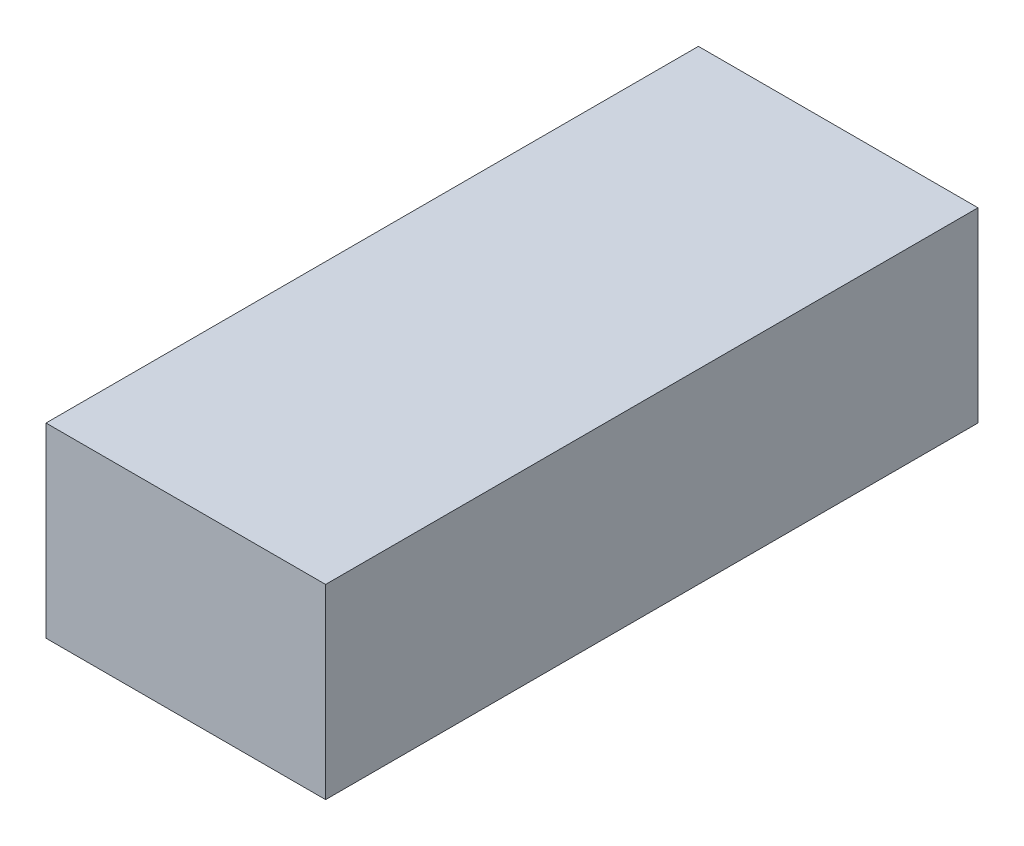
ISO-10303-21;
HEADER;
FILE_DESCRIPTION(('STEP AP214'),'2;1');
FILE_NAME('part.step','',(''),(''),'','','');
FILE_SCHEMA(('AUTOMOTIVE_DESIGN { 1 0 10303 214 1 1 1 1 }'));
ENDSEC;
DATA;
#1=APPLICATION_CONTEXT('core data for automotive mechanical design processes');
#2=APPLICATION_PROTOCOL_DEFINITION('international standard','automotive_design',2000,#1);
#3=PRODUCT_CONTEXT('',#1,'mechanical');
#4=PRODUCT('Part','Part','',(#3));
#5=PRODUCT_RELATED_PRODUCT_CATEGORY('part','',(#4));
#6=PRODUCT_DEFINITION_FORMATION('','',#4);
#7=PRODUCT_DEFINITION_CONTEXT('part definition',#1,'design');
#8=PRODUCT_DEFINITION('design','',#6,#7);
#9=PRODUCT_DEFINITION_SHAPE('','',#8);
#10=(LENGTH_UNIT() NAMED_UNIT(*) SI_UNIT(.MILLI.,.METRE.));
#11=(NAMED_UNIT(*) PLANE_ANGLE_UNIT() SI_UNIT($,.RADIAN.));
#12=(NAMED_UNIT(*) SI_UNIT($,.STERADIAN.) SOLID_ANGLE_UNIT());
#13=UNCERTAINTY_MEASURE_WITH_UNIT(LENGTH_MEASURE(1.E-05),#10,'distance_accuracy_value','');
#14=(GEOMETRIC_REPRESENTATION_CONTEXT(3) GLOBAL_UNCERTAINTY_ASSIGNED_CONTEXT((#13)) GLOBAL_UNIT_ASSIGNED_CONTEXT((#10,
#11,#12)) REPRESENTATION_CONTEXT('',''));
#15=CARTESIAN_POINT('',(0.,0.,0.));
#16=DIRECTION('',(0.,0.,1.));
#17=DIRECTION('',(1.,0.,0.));
#18=AXIS2_PLACEMENT_3D('',#15,#16,#17);
#19=CARTESIAN_POINT('',(0.,20.32,0.));
#20=DIRECTION('',(1.,0.,0.));
#21=DIRECTION('',(0.,0.,-1.));
#22=AXIS2_PLACEMENT_3D('',#19,#20,#21);
#23=PLANE('',#22);
#24=DIRECTION('',(0.,0.,1.));
#25=VECTOR('',#24,1.);
#26=CARTESIAN_POINT('',(0.,0.,0.));
#27=LINE('',#26,#25);
#28=CARTESIAN_POINT('',(0.,0.,-71.12));
#29=VERTEX_POINT('',#28);
#30=CARTESIAN_POINT('',(0.,0.,0.));
#31=VERTEX_POINT('',#30);
#32=EDGE_CURVE('E102',#29,#31,#27,.T.);
#33=ORIENTED_EDGE('',*,*,#32,.T.);
#34=DIRECTION('',(0.,-1.,0.));
#35=VECTOR('',#34,1.);
#36=CARTESIAN_POINT('',(0.,20.32,0.));
#37=LINE('',#36,#35);
#38=CARTESIAN_POINT('',(0.,20.32,0.));
#39=VERTEX_POINT('',#38);
#40=EDGE_CURVE('E11',#39,#31,#37,.T.);
#41=ORIENTED_EDGE('',*,*,#40,.F.);
#42=DIRECTION('',(0.,0.,1.));
#43=VECTOR('',#42,1.);
#44=CARTESIAN_POINT('',(0.,20.32,0.));
#45=LINE('',#44,#43);
#46=CARTESIAN_POINT('',(0.,20.32,-71.12));
#47=VERTEX_POINT('',#46);
#48=EDGE_CURVE('E90',#47,#39,#45,.T.);
#49=ORIENTED_EDGE('',*,*,#48,.F.);
#50=DIRECTION('',(0.,-1.,0.));
#51=VECTOR('',#50,1.);
#52=CARTESIAN_POINT('',(0.,20.32,-71.12));
#53=LINE('',#52,#51);
#54=EDGE_CURVE('E98',#47,#29,#53,.T.);
#55=ORIENTED_EDGE('',*,*,#54,.T.);
#56=EDGE_LOOP('',(#33,#41,#49,#55));
#57=FACE_BOUND('',#56,.T.);
#58=ADVANCED_FACE('F39',(#57),#23,.F.);
#59=CARTESIAN_POINT('',(0.,20.32,0.));
#60=DIRECTION('',(0.,0.,-1.));
#61=DIRECTION('',(-1.,0.,0.));
#62=AXIS2_PLACEMENT_3D('',#59,#60,#61);
#63=PLANE('',#62);
#64=DIRECTION('',(1.,0.,0.));
#65=VECTOR('',#64,1.);
#66=CARTESIAN_POINT('',(0.,0.,0.));
#67=LINE('',#66,#65);
#68=CARTESIAN_POINT('',(30.48,0.,0.));
#69=VERTEX_POINT('',#68);
#70=EDGE_CURVE('E94',#31,#69,#67,.T.);
#71=ORIENTED_EDGE('',*,*,#70,.T.);
#72=DIRECTION('',(0.,-1.,0.));
#73=VECTOR('',#72,1.);
#74=CARTESIAN_POINT('',(30.48,20.32,0.));
#75=LINE('',#74,#73);
#76=CARTESIAN_POINT('',(30.48,20.32,0.));
#77=VERTEX_POINT('',#76);
#78=EDGE_CURVE('E47',#77,#69,#75,.T.);
#79=ORIENTED_EDGE('',*,*,#78,.F.);
#80=DIRECTION('',(1.,0.,0.));
#81=VECTOR('',#80,1.);
#82=CARTESIAN_POINT('',(0.,20.32,0.));
#83=LINE('',#82,#81);
#84=EDGE_CURVE('E85',#39,#77,#83,.T.);
#85=ORIENTED_EDGE('',*,*,#84,.F.);
#86=ORIENTED_EDGE('',*,*,#40,.T.);
#87=EDGE_LOOP('',(#71,#79,#85,#86));
#88=FACE_BOUND('',#87,.T.);
#89=ADVANCED_FACE('F93',(#88),#63,.F.);
#90=CARTESIAN_POINT('',(30.48,20.32,0.));
#91=DIRECTION('',(-1.,0.,0.));
#92=DIRECTION('',(0.,0.,1.));
#93=AXIS2_PLACEMENT_3D('',#90,#91,#92);
#94=PLANE('',#93);
#95=DIRECTION('',(0.,0.,-1.));
#96=VECTOR('',#95,1.);
#97=CARTESIAN_POINT('',(30.48,0.,0.));
#98=LINE('',#97,#96);
#99=CARTESIAN_POINT('',(30.48,0.,-71.12));
#100=VERTEX_POINT('',#99);
#101=EDGE_CURVE('E72',#69,#100,#98,.T.);
#102=ORIENTED_EDGE('',*,*,#101,.T.);
#103=DIRECTION('',(0.,-1.,0.));
#104=VECTOR('',#103,1.);
#105=CARTESIAN_POINT('',(30.48,20.32,-71.12));
#106=LINE('',#105,#104);
#107=CARTESIAN_POINT('',(30.48,20.32,-71.12));
#108=VERTEX_POINT('',#107);
#109=EDGE_CURVE('E95',#108,#100,#106,.T.);
#110=ORIENTED_EDGE('',*,*,#109,.F.);
#111=DIRECTION('',(0.,0.,-1.));
#112=VECTOR('',#111,1.);
#113=CARTESIAN_POINT('',(30.48,20.32,0.));
#114=LINE('',#113,#112);
#115=EDGE_CURVE('E88',#77,#108,#114,.T.);
#116=ORIENTED_EDGE('',*,*,#115,.F.);
#117=ORIENTED_EDGE('',*,*,#78,.T.);
#118=EDGE_LOOP('',(#102,#110,#116,#117));
#119=FACE_BOUND('',#118,.T.);
#120=ADVANCED_FACE('F96',(#119),#94,.F.);
#121=CARTESIAN_POINT('',(0.,20.32,-71.12));
#122=DIRECTION('',(0.,0.,1.));
#123=DIRECTION('',(1.,0.,0.));
#124=AXIS2_PLACEMENT_3D('',#121,#122,#123);
#125=PLANE('',#124);
#126=DIRECTION('',(-1.,0.,0.));
#127=VECTOR('',#126,1.);
#128=CARTESIAN_POINT('',(0.,0.,-71.12));
#129=LINE('',#128,#127);
#130=EDGE_CURVE('E78',#100,#29,#129,.T.);
#131=ORIENTED_EDGE('',*,*,#130,.T.);
#132=ORIENTED_EDGE('',*,*,#54,.F.);
#133=DIRECTION('',(-1.,0.,0.));
#134=VECTOR('',#133,1.);
#135=CARTESIAN_POINT('',(0.,20.32,-71.12));
#136=LINE('',#135,#134);
#137=EDGE_CURVE('E55',#108,#47,#136,.T.);
#138=ORIENTED_EDGE('',*,*,#137,.F.);
#139=ORIENTED_EDGE('',*,*,#109,.T.);
#140=EDGE_LOOP('',(#131,#132,#138,#139));
#141=FACE_BOUND('',#140,.T.);
#142=ADVANCED_FACE('F109',(#141),#125,.F.);
#143=CARTESIAN_POINT('',(0.,20.32,0.));
#144=DIRECTION('',(0.,-1.,0.));
#145=DIRECTION('',(0.,0.,-1.));
#146=AXIS2_PLACEMENT_3D('',#143,#144,#145);
#147=PLANE('',#146);
#148=ORIENTED_EDGE('',*,*,#48,.T.);
#149=ORIENTED_EDGE('',*,*,#84,.T.);
#150=ORIENTED_EDGE('',*,*,#115,.T.);
#151=ORIENTED_EDGE('',*,*,#137,.T.);
#152=EDGE_LOOP('',(#148,#149,#150,#151));
#153=FACE_BOUND('',#152,.T.);
#154=ADVANCED_FACE('F86',(#153),#147,.F.);
#155=CARTESIAN_POINT('',(0.,0.,0.));
#156=DIRECTION('',(0.,-1.,0.));
#157=DIRECTION('',(0.,0.,-1.));
#158=AXIS2_PLACEMENT_3D('',#155,#156,#157);
#159=PLANE('',#158);
#160=ORIENTED_EDGE('',*,*,#32,.F.);
#161=ORIENTED_EDGE('',*,*,#130,.F.);
#162=ORIENTED_EDGE('',*,*,#101,.F.);
#163=ORIENTED_EDGE('',*,*,#70,.F.);
#164=EDGE_LOOP('',(#160,#161,#162,#163));
#165=FACE_BOUND('',#164,.T.);
#166=ADVANCED_FACE('F112',(#165),#159,.T.);
#167=CLOSED_SHELL('',(#58,#89,#120,#142,#154,#166));
#168=MANIFOLD_SOLID_BREP('B2',#167);
#169=ADVANCED_BREP_SHAPE_REPRESENTATION('',(#18,#168),#14);
#170=SHAPE_DEFINITION_REPRESENTATION(#9,#169);
ENDSEC;
END-ISO-10303-21;
